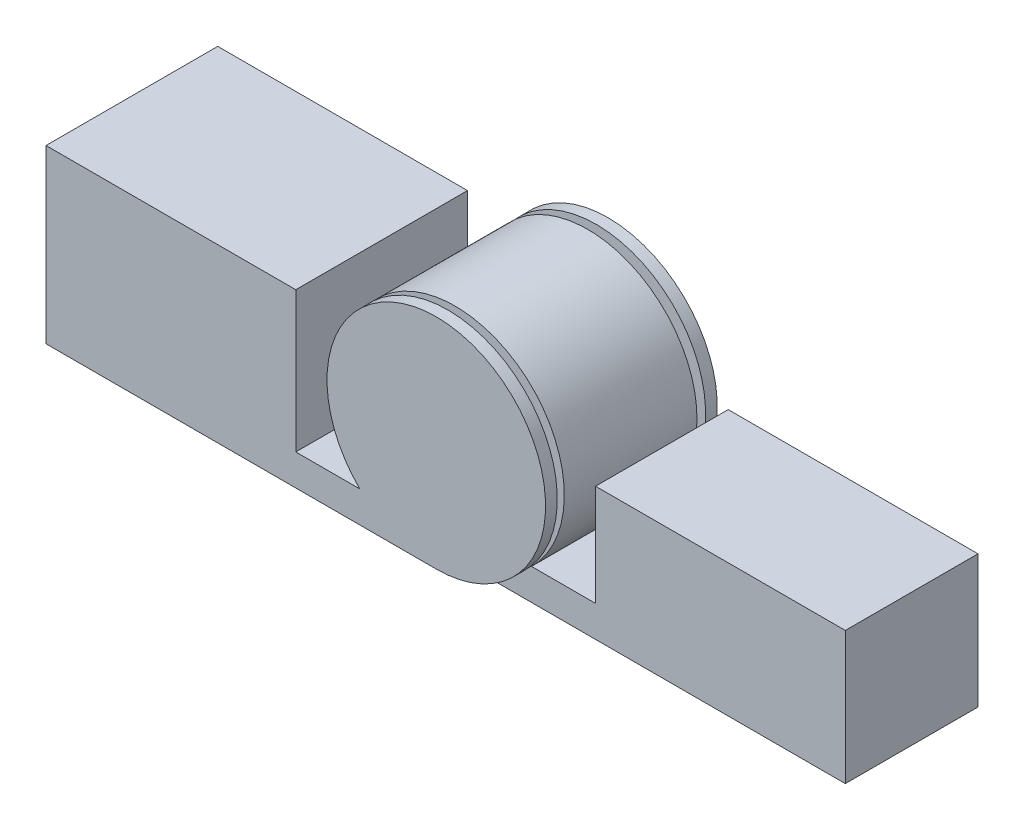
ISO-10303-21;
HEADER;
FILE_DESCRIPTION(('STEP AP214'),'2;1');
FILE_NAME('part.step','',(''),(''),'','','');
FILE_SCHEMA(('AUTOMOTIVE_DESIGN { 1 0 10303 214 1 1 1 1 }'));
ENDSEC;
DATA;
#1=APPLICATION_CONTEXT('core data for automotive mechanical design processes');
#2=APPLICATION_PROTOCOL_DEFINITION('international standard','automotive_design',2000,#1);
#3=PRODUCT_CONTEXT('',#1,'mechanical');
#4=PRODUCT('Part','Part','',(#3));
#5=PRODUCT_RELATED_PRODUCT_CATEGORY('part','',(#4));
#6=PRODUCT_DEFINITION_FORMATION('','',#4);
#7=PRODUCT_DEFINITION_CONTEXT('part definition',#1,'design');
#8=PRODUCT_DEFINITION('design','',#6,#7);
#9=PRODUCT_DEFINITION_SHAPE('','',#8);
#10=(LENGTH_UNIT() NAMED_UNIT(*) SI_UNIT(.MILLI.,.METRE.));
#11=(NAMED_UNIT(*) PLANE_ANGLE_UNIT() SI_UNIT($,.RADIAN.));
#12=(NAMED_UNIT(*) SI_UNIT($,.STERADIAN.) SOLID_ANGLE_UNIT());
#13=UNCERTAINTY_MEASURE_WITH_UNIT(LENGTH_MEASURE(1.E-05),#10,'distance_accuracy_value','');
#14=(GEOMETRIC_REPRESENTATION_CONTEXT(3) GLOBAL_UNCERTAINTY_ASSIGNED_CONTEXT((#13)) GLOBAL_UNIT_ASSIGNED_CONTEXT((#10,
#11,#12)) REPRESENTATION_CONTEXT('',''));
#15=CARTESIAN_POINT('',(0.,0.,0.));
#16=DIRECTION('',(0.,0.,1.));
#17=DIRECTION('',(1.,0.,0.));
#18=AXIS2_PLACEMENT_3D('',#15,#16,#17);
#19=CARTESIAN_POINT('',(317.5,88.9,391.147171389936));
#20=DIRECTION('',(0.,0.,-1.));
#21=DIRECTION('',(-1.,0.,0.));
#22=AXIS2_PLACEMENT_3D('',#19,#20,#21);
#23=CYLINDRICAL_SURFACE('',#22,88.9);
#24=DIRECTION('',(0.,0.,-1.));
#25=VECTOR('',#24,1.);
#26=CARTESIAN_POINT('',(255.282960533307,25.4,139.7));
#27=LINE('',#26,#25);
#28=CARTESIAN_POINT('',(255.282960533307,25.4,16.51));
#29=VERTEX_POINT('',#28);
#30=CARTESIAN_POINT('',(255.282960533307,25.4,9.52500000000001));
#31=VERTEX_POINT('',#30);
#32=EDGE_CURVE('E59',#29,#31,#27,.T.);
#33=ORIENTED_EDGE('',*,*,#32,.F.);
#34=CARTESIAN_POINT('',(317.5,88.9,16.51));
#35=DIRECTION('',(0.,0.,1.));
#36=DIRECTION('',(1.,0.,0.));
#37=AXIS2_PLACEMENT_3D('',#34,#35,#36);
#38=CIRCLE('',#37,88.9);
#39=CARTESIAN_POINT('',(317.5,0.,16.51));
#40=VERTEX_POINT('',#39);
#41=EDGE_CURVE('E44',#29,#40,#38,.T.);
#42=ORIENTED_EDGE('',*,*,#41,.T.);
#43=DIRECTION('',(0.,0.,-1.));
#44=VECTOR('',#43,1.);
#45=CARTESIAN_POINT('',(317.5,0.,391.147171389936));
#46=LINE('',#45,#44);
#47=CARTESIAN_POINT('',(317.5,0.,9.52500000000001));
#48=VERTEX_POINT('',#47);
#49=EDGE_CURVE('E205',#48,#40,#46,.F.);
#50=ORIENTED_EDGE('',*,*,#49,.F.);
#51=CARTESIAN_POINT('',(317.5,88.9,9.52500000000001));
#52=DIRECTION('',(0.,0.,1.));
#53=DIRECTION('',(1.,0.,0.));
#54=AXIS2_PLACEMENT_3D('',#51,#52,#53);
#55=CIRCLE('',#54,88.9);
#56=EDGE_CURVE('E198',#48,#31,#55,.F.);
#57=ORIENTED_EDGE('',*,*,#56,.T.);
#58=EDGE_LOOP('',(#33,#42,#50,#57));
#59=FACE_BOUND('',#58,.T.);
#60=ADVANCED_FACE('F36',(#59),#23,.F.);
#61=CARTESIAN_POINT('',(317.5,88.9,139.7));
#62=DIRECTION('',(0.,0.,-1.));
#63=DIRECTION('',(-1.,0.,0.));
#64=AXIS2_PLACEMENT_3D('',#61,#62,#63);
#65=CYLINDRICAL_SURFACE('',#64,88.9);
#66=EDGE_CURVE('E191',#31,#48,#55,.F.);
#67=ORIENTED_EDGE('',*,*,#66,.T.);
#68=DIRECTION('',(0.,0.,-1.));
#69=VECTOR('',#68,1.);
#70=CARTESIAN_POINT('',(317.5,0.,139.7));
#71=LINE('',#70,#69);
#72=CARTESIAN_POINT('',(317.5,0.,0.));
#73=VERTEX_POINT('',#72);
#74=EDGE_CURVE('E247',#48,#73,#71,.T.);
#75=ORIENTED_EDGE('',*,*,#74,.T.);
#76=CARTESIAN_POINT('',(317.5,88.9,0.));
#77=DIRECTION('',(0.,0.,1.));
#78=DIRECTION('',(1.,0.,0.));
#79=AXIS2_PLACEMENT_3D('',#76,#77,#78);
#80=CIRCLE('',#79,88.9);
#81=CARTESIAN_POINT('',(255.282960533307,25.4,0.));
#82=VERTEX_POINT('',#81);
#83=EDGE_CURVE('E237',#73,#82,#80,.T.);
#84=ORIENTED_EDGE('',*,*,#83,.T.);
#85=EDGE_CURVE('E254',#31,#82,#27,.T.);
#86=ORIENTED_EDGE('',*,*,#85,.F.);
#87=EDGE_LOOP('',(#67,#75,#84,#86));
#88=FACE_BOUND('',#87,.T.);
#89=ADVANCED_FACE('F268',(#88),#65,.T.);
#90=CARTESIAN_POINT('',(0.,0.,139.7));
#91=DIRECTION('',(-1.,0.,0.));
#92=DIRECTION('',(0.,0.,1.));
#93=AXIS2_PLACEMENT_3D('',#90,#91,#92);
#94=PLANE('',#93);
#95=DIRECTION('',(0.,1.,0.));
#96=VECTOR('',#95,1.);
#97=CARTESIAN_POINT('',(0.,0.,0.));
#98=LINE('',#97,#96);
#99=CARTESIAN_POINT('',(0.,0.,0.));
#100=VERTEX_POINT('',#99);
#101=CARTESIAN_POINT('',(0.,139.7,0.));
#102=VERTEX_POINT('',#101);
#103=EDGE_CURVE('E208',#100,#102,#98,.T.);
#104=ORIENTED_EDGE('',*,*,#103,.F.);
#105=DIRECTION('',(0.,0.,-1.));
#106=VECTOR('',#105,1.);
#107=CARTESIAN_POINT('',(0.,0.,139.7));
#108=LINE('',#107,#106);
#109=CARTESIAN_POINT('',(0.,0.,139.7));
#110=VERTEX_POINT('',#109);
#111=EDGE_CURVE('E242',#110,#100,#108,.T.);
#112=ORIENTED_EDGE('',*,*,#111,.F.);
#113=DIRECTION('',(0.,1.,0.));
#114=VECTOR('',#113,1.);
#115=CARTESIAN_POINT('',(0.,0.,139.7));
#116=LINE('',#115,#114);
#117=CARTESIAN_POINT('',(0.,139.7,139.7));
#118=VERTEX_POINT('',#117);
#119=EDGE_CURVE('E209',#110,#118,#116,.T.);
#120=ORIENTED_EDGE('',*,*,#119,.T.);
#121=DIRECTION('',(0.,0.,-1.));
#122=VECTOR('',#121,1.);
#123=CARTESIAN_POINT('',(0.,139.7,139.7));
#124=LINE('',#123,#122);
#125=EDGE_CURVE('E225',#118,#102,#124,.T.);
#126=ORIENTED_EDGE('',*,*,#125,.T.);
#127=EDGE_LOOP('',(#104,#112,#120,#126));
#128=FACE_BOUND('',#127,.T.);
#129=ADVANCED_FACE('F38',(#128),#94,.T.);
#130=CARTESIAN_POINT('',(0.,0.,139.7));
#131=DIRECTION('',(0.,1.,0.));
#132=DIRECTION('',(0.,0.,1.));
#133=AXIS2_PLACEMENT_3D('',#130,#131,#132);
#134=PLANE('',#133);
#135=DIRECTION('',(1.,0.,0.));
#136=VECTOR('',#135,1.);
#137=CARTESIAN_POINT('',(0.,0.,0.));
#138=LINE('',#137,#136);
#139=EDGE_CURVE('E213',#100,#73,#138,.T.);
#140=ORIENTED_EDGE('',*,*,#139,.T.);
#141=ORIENTED_EDGE('',*,*,#74,.F.);
#142=ORIENTED_EDGE('',*,*,#49,.T.);
#143=DIRECTION('',(1.,0.,0.));
#144=VECTOR('',#143,1.);
#145=CARTESIAN_POINT('',(317.5,0.,16.51));
#146=LINE('',#145,#144);
#147=CARTESIAN_POINT('',(635.,0.,16.51));
#148=VERTEX_POINT('',#147);
#149=EDGE_CURVE('E51',#40,#148,#146,.T.);
#150=ORIENTED_EDGE('',*,*,#149,.T.);
#151=DIRECTION('',(0.,0.,-1.));
#152=VECTOR('',#151,1.);
#153=CARTESIAN_POINT('',(635.,0.,124.46));
#154=LINE('',#153,#152);
#155=CARTESIAN_POINT('',(635.,0.,124.46));
#156=VERTEX_POINT('',#155);
#157=EDGE_CURVE('E194',#156,#148,#154,.T.);
#158=ORIENTED_EDGE('',*,*,#157,.F.);
#159=DIRECTION('',(1.,0.,0.));
#160=VECTOR('',#159,1.);
#161=CARTESIAN_POINT('',(431.8,0.,124.46));
#162=LINE('',#161,#160);
#163=CARTESIAN_POINT('',(317.5,0.,124.46));
#164=VERTEX_POINT('',#163);
#165=EDGE_CURVE('E175',#164,#156,#162,.T.);
#166=ORIENTED_EDGE('',*,*,#165,.F.);
#167=CARTESIAN_POINT('',(317.5,0.,130.175));
#168=VERTEX_POINT('',#167);
#169=EDGE_CURVE('E204',#164,#168,#46,.F.);
#170=ORIENTED_EDGE('',*,*,#169,.T.);
#171=CARTESIAN_POINT('',(317.5,0.,139.7));
#172=VERTEX_POINT('',#171);
#173=EDGE_CURVE('E244',#172,#168,#71,.T.);
#174=ORIENTED_EDGE('',*,*,#173,.F.);
#175=DIRECTION('',(1.,0.,0.));
#176=VECTOR('',#175,1.);
#177=CARTESIAN_POINT('',(203.2,0.,139.7));
#178=LINE('',#177,#176);
#179=EDGE_CURVE('E223',#110,#172,#178,.T.);
#180=ORIENTED_EDGE('',*,*,#179,.F.);
#181=ORIENTED_EDGE('',*,*,#111,.T.);
#182=EDGE_LOOP('',(#140,#141,#142,#150,#158,#166,#170,#174,#180,#181));
#183=FACE_BOUND('',#182,.T.);
#184=ADVANCED_FACE('F262',(#183),#134,.F.);
#185=ORIENTED_EDGE('',*,*,#173,.T.);
#186=CARTESIAN_POINT('',(317.5,88.9,130.175));
#187=DIRECTION('',(0.,0.,1.));
#188=DIRECTION('',(1.,0.,0.));
#189=AXIS2_PLACEMENT_3D('',#186,#187,#188);
#190=CIRCLE('',#189,88.9);
#191=CARTESIAN_POINT('',(255.282960533307,25.4,130.175));
#192=VERTEX_POINT('',#191);
#193=EDGE_CURVE('E200',#168,#192,#190,.T.);
#194=ORIENTED_EDGE('',*,*,#193,.T.);
#195=CARTESIAN_POINT('',(255.282960533307,25.4,139.7));
#196=VERTEX_POINT('',#195);
#197=EDGE_CURVE('E248',#196,#192,#27,.T.);
#198=ORIENTED_EDGE('',*,*,#197,.F.);
#199=CARTESIAN_POINT('',(317.5,88.9,139.7));
#200=DIRECTION('',(0.,0.,1.));
#201=DIRECTION('',(1.,0.,0.));
#202=AXIS2_PLACEMENT_3D('',#199,#200,#201);
#203=CIRCLE('',#202,88.9);
#204=EDGE_CURVE('E221',#172,#196,#203,.T.);
#205=ORIENTED_EDGE('',*,*,#204,.F.);
#206=EDGE_LOOP('',(#185,#194,#198,#205));
#207=FACE_BOUND('',#206,.T.);
#208=ADVANCED_FACE('F291',(#207),#65,.T.);
#209=CARTESIAN_POINT('',(203.2,25.4,139.7));
#210=DIRECTION('',(0.,1.,0.));
#211=DIRECTION('',(-1.,0.,0.));
#212=AXIS2_PLACEMENT_3D('',#209,#210,#211);
#213=PLANE('',#212);
#214=DIRECTION('',(1.,0.,0.));
#215=VECTOR('',#214,1.);
#216=CARTESIAN_POINT('',(203.2,25.4,0.));
#217=LINE('',#216,#215);
#218=CARTESIAN_POINT('',(203.2,25.4,0.));
#219=VERTEX_POINT('',#218);
#220=EDGE_CURVE('E234',#219,#82,#217,.T.);
#221=ORIENTED_EDGE('',*,*,#220,.F.);
#222=DIRECTION('',(0.,0.,-1.));
#223=VECTOR('',#222,1.);
#224=CARTESIAN_POINT('',(203.2,25.4,139.7));
#225=LINE('',#224,#223);
#226=CARTESIAN_POINT('',(203.2,25.4,139.7));
#227=VERTEX_POINT('',#226);
#228=EDGE_CURVE('E252',#227,#219,#225,.T.);
#229=ORIENTED_EDGE('',*,*,#228,.F.);
#230=DIRECTION('',(1.,0.,0.));
#231=VECTOR('',#230,1.);
#232=CARTESIAN_POINT('',(203.2,25.4,139.7));
#233=LINE('',#232,#231);
#234=EDGE_CURVE('E218',#227,#196,#233,.T.);
#235=ORIENTED_EDGE('',*,*,#234,.T.);
#236=ORIENTED_EDGE('',*,*,#197,.T.);
#237=CARTESIAN_POINT('',(255.282960533307,25.4,124.46));
#238=VERTEX_POINT('',#237);
#239=EDGE_CURVE('E251',#192,#238,#27,.T.);
#240=ORIENTED_EDGE('',*,*,#239,.T.);
#241=EDGE_CURVE('E308',#238,#29,#27,.T.);
#242=ORIENTED_EDGE('',*,*,#241,.T.);
#243=ORIENTED_EDGE('',*,*,#32,.T.);
#244=ORIENTED_EDGE('',*,*,#85,.T.);
#245=EDGE_LOOP('',(#221,#229,#235,#236,#240,#242,#243,#244));
#246=FACE_BOUND('',#245,.T.);
#247=ADVANCED_FACE('F307',(#246),#213,.T.);
#248=CARTESIAN_POINT('',(203.2,25.4,139.7));
#249=DIRECTION('',(-1.,0.,0.));
#250=DIRECTION('',(0.,0.,1.));
#251=AXIS2_PLACEMENT_3D('',#248,#249,#250);
#252=PLANE('',#251);
#253=DIRECTION('',(0.,1.,0.));
#254=VECTOR('',#253,1.);
#255=CARTESIAN_POINT('',(203.2,25.4,0.));
#256=LINE('',#255,#254);
#257=CARTESIAN_POINT('',(203.2,139.7,0.));
#258=VERTEX_POINT('',#257);
#259=EDGE_CURVE('E231',#219,#258,#256,.T.);
#260=ORIENTED_EDGE('',*,*,#259,.T.);
#261=DIRECTION('',(0.,0.,-1.));
#262=VECTOR('',#261,1.);
#263=CARTESIAN_POINT('',(203.2,139.7,139.7));
#264=LINE('',#263,#262);
#265=CARTESIAN_POINT('',(203.2,139.7,139.7));
#266=VERTEX_POINT('',#265);
#267=EDGE_CURVE('E255',#266,#258,#264,.T.);
#268=ORIENTED_EDGE('',*,*,#267,.F.);
#269=DIRECTION('',(0.,1.,0.));
#270=VECTOR('',#269,1.);
#271=CARTESIAN_POINT('',(203.2,25.4,139.7));
#272=LINE('',#271,#270);
#273=EDGE_CURVE('E216',#227,#266,#272,.T.);
#274=ORIENTED_EDGE('',*,*,#273,.F.);
#275=ORIENTED_EDGE('',*,*,#228,.T.);
#276=EDGE_LOOP('',(#260,#268,#274,#275));
#277=FACE_BOUND('',#276,.T.);
#278=ADVANCED_FACE('F315',(#277),#252,.F.);
#279=CARTESIAN_POINT('',(0.,139.7,139.7));
#280=DIRECTION('',(0.,1.,0.));
#281=DIRECTION('',(0.,0.,1.));
#282=AXIS2_PLACEMENT_3D('',#279,#280,#281);
#283=PLANE('',#282);
#284=DIRECTION('',(1.,0.,0.));
#285=VECTOR('',#284,1.);
#286=CARTESIAN_POINT('',(0.,139.7,0.));
#287=LINE('',#286,#285);
#288=EDGE_CURVE('E228',#102,#258,#287,.T.);
#289=ORIENTED_EDGE('',*,*,#288,.F.);
#290=ORIENTED_EDGE('',*,*,#125,.F.);
#291=DIRECTION('',(1.,0.,0.));
#292=VECTOR('',#291,1.);
#293=CARTESIAN_POINT('',(0.,139.7,139.7));
#294=LINE('',#293,#292);
#295=EDGE_CURVE('E212',#118,#266,#294,.T.);
#296=ORIENTED_EDGE('',*,*,#295,.T.);
#297=ORIENTED_EDGE('',*,*,#267,.T.);
#298=EDGE_LOOP('',(#289,#290,#296,#297));
#299=FACE_BOUND('',#298,.T.);
#300=ADVANCED_FACE('F451',(#299),#283,.T.);
#301=CARTESIAN_POINT('',(317.5,88.9,139.7));
#302=DIRECTION('',(0.,0.,1.));
#303=DIRECTION('',(1.,0.,0.));
#304=AXIS2_PLACEMENT_3D('',#301,#302,#303);
#305=PLANE('',#304);
#306=ORIENTED_EDGE('',*,*,#119,.F.);
#307=ORIENTED_EDGE('',*,*,#179,.T.);
#308=ORIENTED_EDGE('',*,*,#204,.T.);
#309=ORIENTED_EDGE('',*,*,#234,.F.);
#310=ORIENTED_EDGE('',*,*,#273,.T.);
#311=ORIENTED_EDGE('',*,*,#295,.F.);
#312=EDGE_LOOP('',(#306,#307,#308,#309,#310,#311));
#313=FACE_BOUND('',#312,.T.);
#314=ADVANCED_FACE('F298',(#313),#305,.T.);
#315=CARTESIAN_POINT('',(317.5,88.9,0.));
#316=DIRECTION('',(0.,0.,1.));
#317=DIRECTION('',(1.,0.,0.));
#318=AXIS2_PLACEMENT_3D('',#315,#316,#317);
#319=PLANE('',#318);
#320=ORIENTED_EDGE('',*,*,#103,.T.);
#321=ORIENTED_EDGE('',*,*,#288,.T.);
#322=ORIENTED_EDGE('',*,*,#259,.F.);
#323=ORIENTED_EDGE('',*,*,#220,.T.);
#324=ORIENTED_EDGE('',*,*,#83,.F.);
#325=ORIENTED_EDGE('',*,*,#139,.F.);
#326=EDGE_LOOP('',(#320,#321,#322,#323,#324,#325));
#327=FACE_BOUND('',#326,.T.);
#328=ADVANCED_FACE('F293',(#327),#319,.F.);
#329=CARTESIAN_POINT('',(317.5,88.9,124.46));
#330=DIRECTION('',(0.,0.,1.));
#331=DIRECTION('',(1.,0.,0.));
#332=AXIS2_PLACEMENT_3D('',#329,#330,#331);
#333=CIRCLE('',#332,88.9);
#334=EDGE_CURVE('E12',#238,#164,#333,.T.);
#335=ORIENTED_EDGE('',*,*,#334,.F.);
#336=ORIENTED_EDGE('',*,*,#239,.F.);
#337=EDGE_CURVE('E201',#192,#168,#190,.T.);
#338=ORIENTED_EDGE('',*,*,#337,.T.);
#339=ORIENTED_EDGE('',*,*,#169,.F.);
#340=EDGE_LOOP('',(#335,#336,#338,#339));
#341=FACE_BOUND('',#340,.T.);
#342=ADVANCED_FACE('F282',(#341),#23,.F.);
#343=CARTESIAN_POINT('',(317.5,88.9,130.175));
#344=DIRECTION('',(0.,0.,1.));
#345=DIRECTION('',(1.,0.,0.));
#346=AXIS2_PLACEMENT_3D('',#343,#344,#345);
#347=PLANE('',#346);
#348=ORIENTED_EDGE('',*,*,#337,.F.);
#349=ORIENTED_EDGE('',*,*,#193,.F.);
#350=EDGE_LOOP('',(#348,#349));
#351=FACE_BOUND('',#350,.T.);
#352=ADVANCED_FACE('F274',(#351),#347,.F.);
#353=CARTESIAN_POINT('',(317.5,88.9,9.525));
#354=DIRECTION('',(0.,0.,1.));
#355=DIRECTION('',(1.,0.,0.));
#356=AXIS2_PLACEMENT_3D('',#353,#354,#355);
#357=PLANE('',#356);
#358=ORIENTED_EDGE('',*,*,#56,.F.);
#359=ORIENTED_EDGE('',*,*,#66,.F.);
#360=EDGE_LOOP('',(#358,#359));
#361=FACE_BOUND('',#360,.T.);
#362=ADVANCED_FACE('F272',(#361),#357,.T.);
#363=CARTESIAN_POINT('',(431.8,25.4,124.46));
#364=DIRECTION('',(-1.,0.,0.));
#365=DIRECTION('',(0.,0.,1.));
#366=AXIS2_PLACEMENT_3D('',#363,#364,#365);
#367=PLANE('',#366);
#368=DIRECTION('',(0.,1.,0.));
#369=VECTOR('',#368,1.);
#370=CARTESIAN_POINT('',(431.8,25.4,16.51));
#371=LINE('',#370,#369);
#372=CARTESIAN_POINT('',(431.8,25.4,16.51));
#373=VERTEX_POINT('',#372);
#374=CARTESIAN_POINT('',(431.8,107.95,16.51));
#375=VERTEX_POINT('',#374);
#376=EDGE_CURVE('E181',#373,#375,#371,.T.);
#377=ORIENTED_EDGE('',*,*,#376,.F.);
#378=DIRECTION('',(0.,0.,-1.));
#379=VECTOR('',#378,1.);
#380=CARTESIAN_POINT('',(431.8,25.4,124.46));
#381=LINE('',#380,#379);
#382=CARTESIAN_POINT('',(431.8,25.4,124.46));
#383=VERTEX_POINT('',#382);
#384=EDGE_CURVE('E167',#383,#373,#381,.T.);
#385=ORIENTED_EDGE('',*,*,#384,.F.);
#386=DIRECTION('',(0.,1.,0.));
#387=VECTOR('',#386,1.);
#388=CARTESIAN_POINT('',(431.8,25.4,124.46));
#389=LINE('',#388,#387);
#390=CARTESIAN_POINT('',(431.8,107.95,124.46));
#391=VERTEX_POINT('',#390);
#392=EDGE_CURVE('E160',#383,#391,#389,.T.);
#393=ORIENTED_EDGE('',*,*,#392,.T.);
#394=DIRECTION('',(0.,0.,-1.));
#395=VECTOR('',#394,1.);
#396=CARTESIAN_POINT('',(431.8,107.95,124.46));
#397=LINE('',#396,#395);
#398=EDGE_CURVE('E143',#391,#375,#397,.T.);
#399=ORIENTED_EDGE('',*,*,#398,.T.);
#400=EDGE_LOOP('',(#377,#385,#393,#399));
#401=FACE_BOUND('',#400,.T.);
#402=ADVANCED_FACE('F166',(#401),#367,.T.);
#403=CARTESIAN_POINT('',(379.717039466693,25.4,124.46));
#404=DIRECTION('',(0.,1.,0.));
#405=DIRECTION('',(-1.,0.,0.));
#406=AXIS2_PLACEMENT_3D('',#403,#404,#405);
#407=PLANE('',#406);
#408=DIRECTION('',(1.,0.,0.));
#409=VECTOR('',#408,1.);
#410=CARTESIAN_POINT('',(379.717039466693,25.4,16.51));
#411=LINE('',#410,#409);
#412=CARTESIAN_POINT('',(379.717039466693,25.4,16.51));
#413=VERTEX_POINT('',#412);
#414=EDGE_CURVE('E168',#413,#373,#411,.T.);
#415=ORIENTED_EDGE('',*,*,#414,.F.);
#416=DIRECTION('',(0.,0.,-1.));
#417=VECTOR('',#416,1.);
#418=CARTESIAN_POINT('',(379.717039466693,25.4,124.46));
#419=LINE('',#418,#417);
#420=CARTESIAN_POINT('',(379.717039466693,25.4,124.46));
#421=VERTEX_POINT('',#420);
#422=EDGE_CURVE('E192',#421,#413,#419,.T.);
#423=ORIENTED_EDGE('',*,*,#422,.F.);
#424=DIRECTION('',(1.,0.,0.));
#425=VECTOR('',#424,1.);
#426=CARTESIAN_POINT('',(379.717039466693,25.4,124.46));
#427=LINE('',#426,#425);
#428=EDGE_CURVE('E154',#421,#383,#427,.T.);
#429=ORIENTED_EDGE('',*,*,#428,.T.);
#430=ORIENTED_EDGE('',*,*,#384,.T.);
#431=EDGE_LOOP('',(#415,#423,#429,#430));
#432=FACE_BOUND('',#431,.T.);
#433=ADVANCED_FACE('F280',(#432),#407,.T.);
#434=CARTESIAN_POINT('',(317.5,88.9,124.46));
#435=DIRECTION('',(0.,0.,-1.));
#436=DIRECTION('',(-1.,0.,0.));
#437=AXIS2_PLACEMENT_3D('',#434,#435,#436);
#438=CYLINDRICAL_SURFACE('',#437,88.9);
#439=ORIENTED_EDGE('',*,*,#241,.F.);
#440=CARTESIAN_POINT('',(317.5,88.9,124.46));
#441=DIRECTION('',(0.,0.,1.));
#442=DIRECTION('',(1.,0.,0.));
#443=AXIS2_PLACEMENT_3D('',#440,#441,#442);
#444=CIRCLE('',#443,88.9);
#445=EDGE_CURVE('E177',#421,#238,#444,.T.);
#446=ORIENTED_EDGE('',*,*,#445,.F.);
#447=ORIENTED_EDGE('',*,*,#422,.T.);
#448=CARTESIAN_POINT('',(317.5,88.9,16.51));
#449=DIRECTION('',(0.,0.,1.));
#450=DIRECTION('',(1.,0.,0.));
#451=AXIS2_PLACEMENT_3D('',#448,#449,#450);
#452=CIRCLE('',#451,88.9);
#453=EDGE_CURVE('E171',#413,#29,#452,.T.);
#454=ORIENTED_EDGE('',*,*,#453,.T.);
#455=EDGE_LOOP('',(#439,#446,#447,#454));
#456=FACE_BOUND('',#455,.T.);
#457=ADVANCED_FACE('F333',(#456),#438,.T.);
#458=CARTESIAN_POINT('',(635.,0.,124.46));
#459=DIRECTION('',(-1.,0.,0.));
#460=DIRECTION('',(0.,0.,1.));
#461=AXIS2_PLACEMENT_3D('',#458,#459,#460);
#462=PLANE('',#461);
#463=DIRECTION('',(0.,1.,0.));
#464=VECTOR('',#463,1.);
#465=CARTESIAN_POINT('',(635.,0.,16.51));
#466=LINE('',#465,#464);
#467=CARTESIAN_POINT('',(635.,107.95,16.51));
#468=VERTEX_POINT('',#467);
#469=EDGE_CURVE('E184',#148,#468,#466,.T.);
#470=ORIENTED_EDGE('',*,*,#469,.T.);
#471=DIRECTION('',(0.,0.,-1.));
#472=VECTOR('',#471,1.);
#473=CARTESIAN_POINT('',(635.,107.95,124.46));
#474=LINE('',#473,#472);
#475=CARTESIAN_POINT('',(635.,107.95,124.46));
#476=VERTEX_POINT('',#475);
#477=EDGE_CURVE('E153',#476,#468,#474,.T.);
#478=ORIENTED_EDGE('',*,*,#477,.F.);
#479=DIRECTION('',(0.,1.,0.));
#480=VECTOR('',#479,1.);
#481=CARTESIAN_POINT('',(635.,0.,124.46));
#482=LINE('',#481,#480);
#483=EDGE_CURVE('E163',#156,#476,#482,.T.);
#484=ORIENTED_EDGE('',*,*,#483,.F.);
#485=ORIENTED_EDGE('',*,*,#157,.T.);
#486=EDGE_LOOP('',(#470,#478,#484,#485));
#487=FACE_BOUND('',#486,.T.);
#488=ADVANCED_FACE('F327',(#487),#462,.F.);
#489=CARTESIAN_POINT('',(431.8,107.95,124.46));
#490=DIRECTION('',(0.,1.,0.));
#491=DIRECTION('',(0.,0.,1.));
#492=AXIS2_PLACEMENT_3D('',#489,#490,#491);
#493=PLANE('',#492);
#494=DIRECTION('',(1.,0.,0.));
#495=VECTOR('',#494,1.);
#496=CARTESIAN_POINT('',(431.8,107.95,16.51));
#497=LINE('',#496,#495);
#498=EDGE_CURVE('E148',#375,#468,#497,.T.);
#499=ORIENTED_EDGE('',*,*,#498,.F.);
#500=ORIENTED_EDGE('',*,*,#398,.F.);
#501=DIRECTION('',(1.,0.,0.));
#502=VECTOR('',#501,1.);
#503=CARTESIAN_POINT('',(431.8,107.95,124.46));
#504=LINE('',#503,#502);
#505=EDGE_CURVE('E146',#391,#476,#504,.T.);
#506=ORIENTED_EDGE('',*,*,#505,.T.);
#507=ORIENTED_EDGE('',*,*,#477,.T.);
#508=EDGE_LOOP('',(#499,#500,#506,#507));
#509=FACE_BOUND('',#508,.T.);
#510=ADVANCED_FACE('F145',(#509),#493,.T.);
#511=CARTESIAN_POINT('',(317.5,88.9,124.46));
#512=DIRECTION('',(0.,0.,1.));
#513=DIRECTION('',(1.,0.,0.));
#514=AXIS2_PLACEMENT_3D('',#511,#512,#513);
#515=PLANE('',#514);
#516=ORIENTED_EDGE('',*,*,#392,.F.);
#517=ORIENTED_EDGE('',*,*,#428,.F.);
#518=ORIENTED_EDGE('',*,*,#445,.T.);
#519=ORIENTED_EDGE('',*,*,#334,.T.);
#520=ORIENTED_EDGE('',*,*,#165,.T.);
#521=ORIENTED_EDGE('',*,*,#483,.T.);
#522=ORIENTED_EDGE('',*,*,#505,.F.);
#523=EDGE_LOOP('',(#516,#517,#518,#519,#520,#521,#522));
#524=FACE_BOUND('',#523,.T.);
#525=ADVANCED_FACE('F158',(#524),#515,.T.);
#526=CARTESIAN_POINT('',(317.5,88.9,16.51));
#527=DIRECTION('',(0.,0.,1.));
#528=DIRECTION('',(1.,0.,0.));
#529=AXIS2_PLACEMENT_3D('',#526,#527,#528);
#530=PLANE('',#529);
#531=ORIENTED_EDGE('',*,*,#376,.T.);
#532=ORIENTED_EDGE('',*,*,#498,.T.);
#533=ORIENTED_EDGE('',*,*,#469,.F.);
#534=ORIENTED_EDGE('',*,*,#149,.F.);
#535=ORIENTED_EDGE('',*,*,#41,.F.);
#536=ORIENTED_EDGE('',*,*,#453,.F.);
#537=ORIENTED_EDGE('',*,*,#414,.T.);
#538=EDGE_LOOP('',(#531,#532,#533,#534,#535,#536,#537));
#539=FACE_BOUND('',#538,.T.);
#540=ADVANCED_FACE('F328',(#539),#530,.F.);
#541=CLOSED_SHELL('',(#60,#89,#129,#184,#208,#247,#278,#300,#314,#328,#342,#352,#362,#402,#433,
#457,#488,#510,#525,#540));
#542=MANIFOLD_SOLID_BREP('B2',#541);
#543=ADVANCED_BREP_SHAPE_REPRESENTATION('',(#18,#542),#14);
#544=SHAPE_DEFINITION_REPRESENTATION(#9,#543);
ENDSEC;
END-ISO-10303-21;
